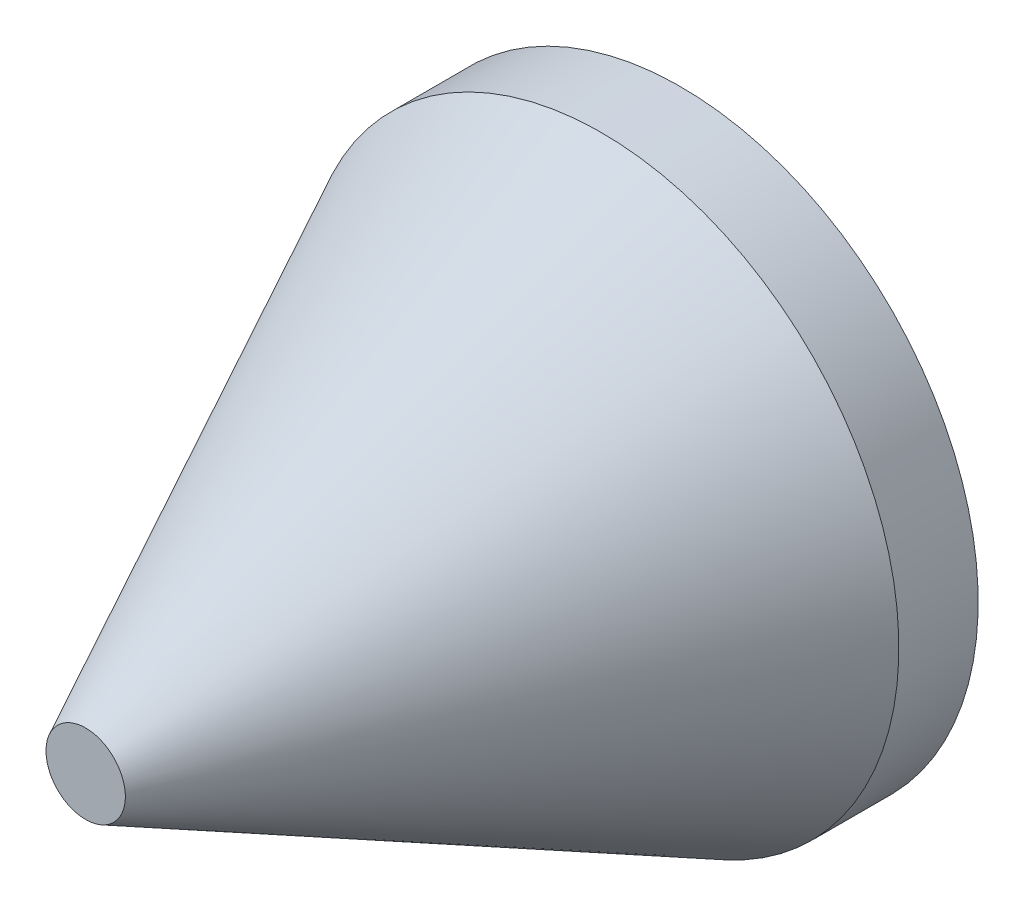
ISO-10303-21;
HEADER;
FILE_DESCRIPTION(('STEP AP214'),'2;1');
FILE_NAME('part.step','',(''),(''),'','','');
FILE_SCHEMA(('AUTOMOTIVE_DESIGN { 1 0 10303 214 1 1 1 1 }'));
ENDSEC;
DATA;
#1=APPLICATION_CONTEXT('core data for automotive mechanical design processes');
#2=APPLICATION_PROTOCOL_DEFINITION('international standard','automotive_design',2000,#1);
#3=PRODUCT_CONTEXT('',#1,'mechanical');
#4=PRODUCT('Part','Part','',(#3));
#5=PRODUCT_RELATED_PRODUCT_CATEGORY('part','',(#4));
#6=PRODUCT_DEFINITION_FORMATION('','',#4);
#7=PRODUCT_DEFINITION_CONTEXT('part definition',#1,'design');
#8=PRODUCT_DEFINITION('design','',#6,#7);
#9=PRODUCT_DEFINITION_SHAPE('','',#8);
#10=(LENGTH_UNIT() NAMED_UNIT(*) SI_UNIT(.MILLI.,.METRE.));
#11=(NAMED_UNIT(*) PLANE_ANGLE_UNIT() SI_UNIT($,.RADIAN.));
#12=(NAMED_UNIT(*) SI_UNIT($,.STERADIAN.) SOLID_ANGLE_UNIT());
#13=UNCERTAINTY_MEASURE_WITH_UNIT(LENGTH_MEASURE(1.E-05),#10,'distance_accuracy_value','');
#14=(GEOMETRIC_REPRESENTATION_CONTEXT(3) GLOBAL_UNCERTAINTY_ASSIGNED_CONTEXT((#13)) GLOBAL_UNIT_ASSIGNED_CONTEXT((#10,
#11,#12)) REPRESENTATION_CONTEXT('',''));
#15=CARTESIAN_POINT('',(0.,0.,0.));
#16=DIRECTION('',(0.,0.,1.));
#17=DIRECTION('',(1.,0.,0.));
#18=AXIS2_PLACEMENT_3D('',#15,#16,#17);
#19=CARTESIAN_POINT('',(0.,0.,150.));
#20=DIRECTION('',(0.,0.,-1.));
#21=DIRECTION('',(-1.,0.,0.));
#22=AXIS2_PLACEMENT_3D('',#19,#20,#21);
#23=PLANE('',#22);
#24=CARTESIAN_POINT('',(0.,0.,150.));
#25=DIRECTION('',(0.,0.,-1.));
#26=DIRECTION('',(-1.,0.,0.));
#27=AXIS2_PLACEMENT_3D('',#24,#25,#26);
#28=CIRCLE('',#27,10.);
#29=CARTESIAN_POINT('',(-10.,0.,150.));
#30=VERTEX_POINT('',#29);
#31=EDGE_CURVE('E40',#30,#30,#28,.T.);
#32=ORIENTED_EDGE('',*,*,#31,.F.);
#33=EDGE_LOOP('',(#32));
#34=FACE_BOUND('',#33,.T.);
#35=ADVANCED_FACE('F30',(#34),#23,.F.);
#36=CARTESIAN_POINT('',(75.,0.,0.));
#37=DIRECTION('',(0.,0.,1.));
#38=DIRECTION('',(1.,0.,0.));
#39=AXIS2_PLACEMENT_3D('',#36,#37,#38);
#40=PLANE('',#39);
#41=CARTESIAN_POINT('',(0.,0.,0.));
#42=DIRECTION('',(0.,0.,-1.));
#43=DIRECTION('',(-1.,0.,0.));
#44=AXIS2_PLACEMENT_3D('',#41,#42,#43);
#45=CIRCLE('',#44,75.);
#46=CARTESIAN_POINT('',(-75.,0.,0.));
#47=VERTEX_POINT('',#46);
#48=EDGE_CURVE('E10',#47,#47,#45,.T.);
#49=ORIENTED_EDGE('',*,*,#48,.T.);
#50=EDGE_LOOP('',(#49));
#51=FACE_BOUND('',#50,.T.);
#52=ADVANCED_FACE('F50',(#51),#40,.F.);
#53=CARTESIAN_POINT('',(0.,0.,-14.5438898450947));
#54=DIRECTION('',(0.,0.,-1.));
#55=DIRECTION('',(-1.,0.,0.));
#56=AXIS2_PLACEMENT_3D('',#53,#54,#55);
#57=CYLINDRICAL_SURFACE('',#56,75.);
#58=ORIENTED_EDGE('',*,*,#48,.F.);
#59=EDGE_LOOP('',(#58));
#60=FACE_BOUND('',#59,.T.);
#61=CARTESIAN_POINT('',(0.,0.,20.));
#62=DIRECTION('',(0.,0.,-1.));
#63=DIRECTION('',(-1.,0.,0.));
#64=AXIS2_PLACEMENT_3D('',#61,#62,#63);
#65=CIRCLE('',#64,75.);
#66=CARTESIAN_POINT('',(-75.,0.,20.));
#67=VERTEX_POINT('',#66);
#68=EDGE_CURVE('E36',#67,#67,#65,.T.);
#69=ORIENTED_EDGE('',*,*,#68,.T.);
#70=EDGE_LOOP('',(#69));
#71=FACE_BOUND('',#70,.T.);
#72=ADVANCED_FACE('F54',(#60,#71),#57,.T.);
#73=CARTESIAN_POINT('',(0.,0.,150.));
#74=DIRECTION('',(0.,0.,-1.));
#75=DIRECTION('',(-1.,0.,0.));
#76=AXIS2_PLACEMENT_3D('',#73,#74,#75);
#77=CONICAL_SURFACE('',#76,10.,0.463647609000806);
#78=ORIENTED_EDGE('',*,*,#68,.F.);
#79=EDGE_LOOP('',(#78));
#80=FACE_BOUND('',#79,.T.);
#81=ORIENTED_EDGE('',*,*,#31,.T.);
#82=EDGE_LOOP('',(#81));
#83=FACE_BOUND('',#82,.T.);
#84=ADVANCED_FACE('F47',(#80,#83),#77,.T.);
#85=CLOSED_SHELL('',(#35,#52,#72,#84));
#86=MANIFOLD_SOLID_BREP('B2',#85);
#87=ADVANCED_BREP_SHAPE_REPRESENTATION('',(#18,#86),#14);
#88=SHAPE_DEFINITION_REPRESENTATION(#9,#87);
ENDSEC;
END-ISO-10303-21;
